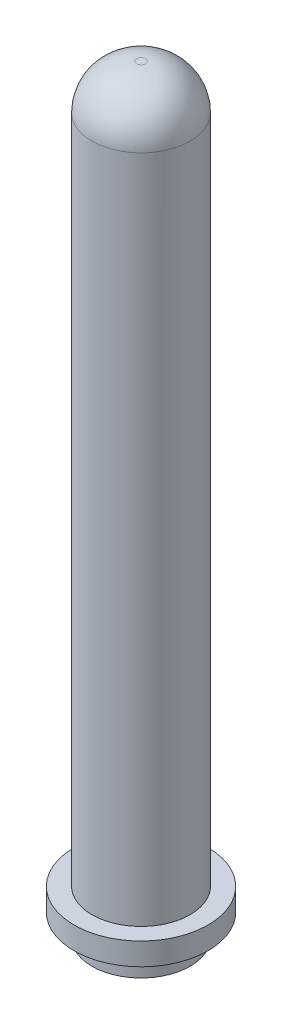
ISO-10303-21;
HEADER;
FILE_DESCRIPTION(('STEP AP214'),'2;1');
FILE_NAME('part.step','',(''),(''),'','','');
FILE_SCHEMA(('AUTOMOTIVE_DESIGN { 1 0 10303 214 1 1 1 1 }'));
ENDSEC;
DATA;
#1=APPLICATION_CONTEXT('core data for automotive mechanical design processes');
#2=APPLICATION_PROTOCOL_DEFINITION('international standard','automotive_design',2000,#1);
#3=PRODUCT_CONTEXT('',#1,'mechanical');
#4=PRODUCT('Part','Part','',(#3));
#5=PRODUCT_RELATED_PRODUCT_CATEGORY('part','',(#4));
#6=PRODUCT_DEFINITION_FORMATION('','',#4);
#7=PRODUCT_DEFINITION_CONTEXT('part definition',#1,'design');
#8=PRODUCT_DEFINITION('design','',#6,#7);
#9=PRODUCT_DEFINITION_SHAPE('','',#8);
#10=(LENGTH_UNIT() NAMED_UNIT(*) SI_UNIT(.MILLI.,.METRE.));
#11=(NAMED_UNIT(*) PLANE_ANGLE_UNIT() SI_UNIT($,.RADIAN.));
#12=(NAMED_UNIT(*) SI_UNIT($,.STERADIAN.) SOLID_ANGLE_UNIT());
#13=UNCERTAINTY_MEASURE_WITH_UNIT(LENGTH_MEASURE(1.E-05),#10,'distance_accuracy_value','');
#14=(GEOMETRIC_REPRESENTATION_CONTEXT(3) GLOBAL_UNCERTAINTY_ASSIGNED_CONTEXT((#13)) GLOBAL_UNIT_ASSIGNED_CONTEXT((#10,
#11,#12)) REPRESENTATION_CONTEXT('',''));
#15=CARTESIAN_POINT('',(0.,0.,0.));
#16=DIRECTION('',(0.,0.,1.));
#17=DIRECTION('',(1.,0.,0.));
#18=AXIS2_PLACEMENT_3D('',#15,#16,#17);
#19=CARTESIAN_POINT('',(-62.,70.,0.));
#20=DIRECTION('',(0.,1.,0.));
#21=DIRECTION('',(0.,0.,1.));
#22=AXIS2_PLACEMENT_3D('',#19,#20,#21);
#23=CYLINDRICAL_SURFACE('',#22,11.);
#24=CARTESIAN_POINT('',(-62.,230.,0.));
#25=DIRECTION('',(0.,1.,0.));
#26=DIRECTION('',(0.,0.,1.));
#27=AXIS2_PLACEMENT_3D('',#24,#25,#26);
#28=CIRCLE('',#27,11.);
#29=CARTESIAN_POINT('',(-62.,230.,11.));
#30=VERTEX_POINT('',#29);
#31=EDGE_CURVE('E10',#30,#30,#28,.F.);
#32=ORIENTED_EDGE('',*,*,#31,.T.);
#33=EDGE_LOOP('',(#32));
#34=FACE_BOUND('',#33,.T.);
#35=CARTESIAN_POINT('',(-62.,80.,0.));
#36=DIRECTION('',(0.,-1.,0.));
#37=DIRECTION('',(0.,0.,-1.));
#38=AXIS2_PLACEMENT_3D('',#35,#36,#37);
#39=CIRCLE('',#38,11.);
#40=CARTESIAN_POINT('',(-62.,80.,-11.));
#41=VERTEX_POINT('',#40);
#42=EDGE_CURVE('E55',#41,#41,#39,.F.);
#43=ORIENTED_EDGE('',*,*,#42,.T.);
#44=EDGE_LOOP('',(#43));
#45=FACE_BOUND('',#44,.T.);
#46=ADVANCED_FACE('F37',(#34,#45),#23,.T.);
#47=CARTESIAN_POINT('',(-62.,240.,0.));
#48=DIRECTION('',(0.,1.,0.));
#49=DIRECTION('',(0.,0.,1.));
#50=AXIS2_PLACEMENT_3D('',#47,#48,#49);
#51=PLANE('',#50);
#52=CARTESIAN_POINT('',(-62.,240.,0.));
#53=DIRECTION('',(0.,1.,0.));
#54=DIRECTION('',(0.,0.,1.));
#55=AXIS2_PLACEMENT_3D('',#52,#53,#54);
#56=CIRCLE('',#55,0.999999999999984);
#57=CARTESIAN_POINT('',(-62.,240.,0.999999999999984));
#58=VERTEX_POINT('',#57);
#59=EDGE_CURVE('E44',#58,#58,#56,.T.);
#60=ORIENTED_EDGE('',*,*,#59,.T.);
#61=EDGE_LOOP('',(#60));
#62=FACE_BOUND('',#61,.T.);
#63=ADVANCED_FACE('F83',(#62),#51,.T.);
#64=CARTESIAN_POINT('',(-62.,80.,0.));
#65=DIRECTION('',(0.,-1.,0.));
#66=DIRECTION('',(0.,0.,-1.));
#67=AXIS2_PLACEMENT_3D('',#64,#65,#66);
#68=CYLINDRICAL_SURFACE('',#67,15.);
#69=CARTESIAN_POINT('',(-62.,80.,0.));
#70=DIRECTION('',(0.,-1.,0.));
#71=DIRECTION('',(0.,0.,-1.));
#72=AXIS2_PLACEMENT_3D('',#69,#70,#71);
#73=CIRCLE('',#72,15.);
#74=CARTESIAN_POINT('',(-62.,80.,-15.));
#75=VERTEX_POINT('',#74);
#76=EDGE_CURVE('E57',#75,#75,#73,.T.);
#77=ORIENTED_EDGE('',*,*,#76,.T.);
#78=EDGE_LOOP('',(#77));
#79=FACE_BOUND('',#78,.T.);
#80=CARTESIAN_POINT('',(-62.,75.,0.));
#81=DIRECTION('',(0.,-1.,0.));
#82=DIRECTION('',(0.,0.,-1.));
#83=AXIS2_PLACEMENT_3D('',#80,#81,#82);
#84=CIRCLE('',#83,15.);
#85=CARTESIAN_POINT('',(-62.,75.,-15.));
#86=VERTEX_POINT('',#85);
#87=EDGE_CURVE('E61',#86,#86,#84,.T.);
#88=ORIENTED_EDGE('',*,*,#87,.F.);
#89=EDGE_LOOP('',(#88));
#90=FACE_BOUND('',#89,.T.);
#91=ADVANCED_FACE('F67',(#79,#90),#68,.T.);
#92=CARTESIAN_POINT('',(-62.,80.,0.));
#93=DIRECTION('',(0.,-1.,0.));
#94=DIRECTION('',(0.,0.,-1.));
#95=AXIS2_PLACEMENT_3D('',#92,#93,#94);
#96=PLANE('',#95);
#97=ORIENTED_EDGE('',*,*,#42,.F.);
#98=EDGE_LOOP('',(#97));
#99=FACE_BOUND('',#98,.T.);
#100=ORIENTED_EDGE('',*,*,#76,.F.);
#101=EDGE_LOOP('',(#100));
#102=FACE_BOUND('',#101,.T.);
#103=ADVANCED_FACE('F70',(#99,#102),#96,.F.);
#104=CARTESIAN_POINT('',(-62.,75.,0.));
#105=DIRECTION('',(0.,-1.,0.));
#106=DIRECTION('',(0.,0.,-1.));
#107=AXIS2_PLACEMENT_3D('',#104,#105,#106);
#108=PLANE('',#107);
#109=CARTESIAN_POINT('',(-62.,75.,0.));
#110=DIRECTION('',(0.,-1.,0.));
#111=DIRECTION('',(0.,0.,-1.));
#112=AXIS2_PLACEMENT_3D('',#109,#110,#111);
#113=CIRCLE('',#112,11.);
#114=CARTESIAN_POINT('',(-62.,75.,-11.));
#115=VERTEX_POINT('',#114);
#116=EDGE_CURVE('E48',#115,#115,#113,.F.);
#117=ORIENTED_EDGE('',*,*,#116,.T.);
#118=EDGE_LOOP('',(#117));
#119=FACE_BOUND('',#118,.T.);
#120=ORIENTED_EDGE('',*,*,#87,.T.);
#121=EDGE_LOOP('',(#120));
#122=FACE_BOUND('',#121,.T.);
#123=ADVANCED_FACE('F72',(#119,#122),#108,.T.);
#124=CARTESIAN_POINT('',(-62.,70.,0.));
#125=DIRECTION('',(0.,1.,0.));
#126=DIRECTION('',(0.,0.,1.));
#127=AXIS2_PLACEMENT_3D('',#124,#125,#126);
#128=PLANE('',#127);
#129=CARTESIAN_POINT('',(-62.,70.,0.));
#130=DIRECTION('',(0.,1.,0.));
#131=DIRECTION('',(0.,0.,1.));
#132=AXIS2_PLACEMENT_3D('',#129,#130,#131);
#133=CIRCLE('',#132,11.);
#134=CARTESIAN_POINT('',(-62.,70.,11.));
#135=VERTEX_POINT('',#134);
#136=EDGE_CURVE('E52',#135,#135,#133,.T.);
#137=ORIENTED_EDGE('',*,*,#136,.F.);
#138=EDGE_LOOP('',(#137));
#139=FACE_BOUND('',#138,.T.);
#140=ADVANCED_FACE('F80',(#139),#128,.F.);
#141=ORIENTED_EDGE('',*,*,#116,.F.);
#142=EDGE_LOOP('',(#141));
#143=FACE_BOUND('',#142,.T.);
#144=ORIENTED_EDGE('',*,*,#136,.T.);
#145=EDGE_LOOP('',(#144));
#146=FACE_BOUND('',#145,.T.);
#147=ADVANCED_FACE('F87',(#143,#146),#23,.T.);
#148=CARTESIAN_POINT('',(-62.,230.,0.));
#149=DIRECTION('',(0.,1.,0.));
#150=DIRECTION('',(0.,0.,1.));
#151=AXIS2_PLACEMENT_3D('',#148,#149,#150);
#152=DEGENERATE_TOROIDAL_SURFACE('',#151,0.999999999999984,10.,.T.);
#153=ORIENTED_EDGE('',*,*,#31,.F.);
#154=EDGE_LOOP('',(#153));
#155=FACE_BOUND('',#154,.T.);
#156=ORIENTED_EDGE('',*,*,#59,.F.);
#157=EDGE_LOOP('',(#156));
#158=FACE_BOUND('',#157,.T.);
#159=ADVANCED_FACE('F39',(#155,#158),#152,.T.);
#160=CLOSED_SHELL('',(#46,#63,#91,#103,#123,#140,#147,#159));
#161=MANIFOLD_SOLID_BREP('B2',#160);
#162=ADVANCED_BREP_SHAPE_REPRESENTATION('',(#18,#161),#14);
#163=SHAPE_DEFINITION_REPRESENTATION(#9,#162);
ENDSEC;
END-ISO-10303-21;
